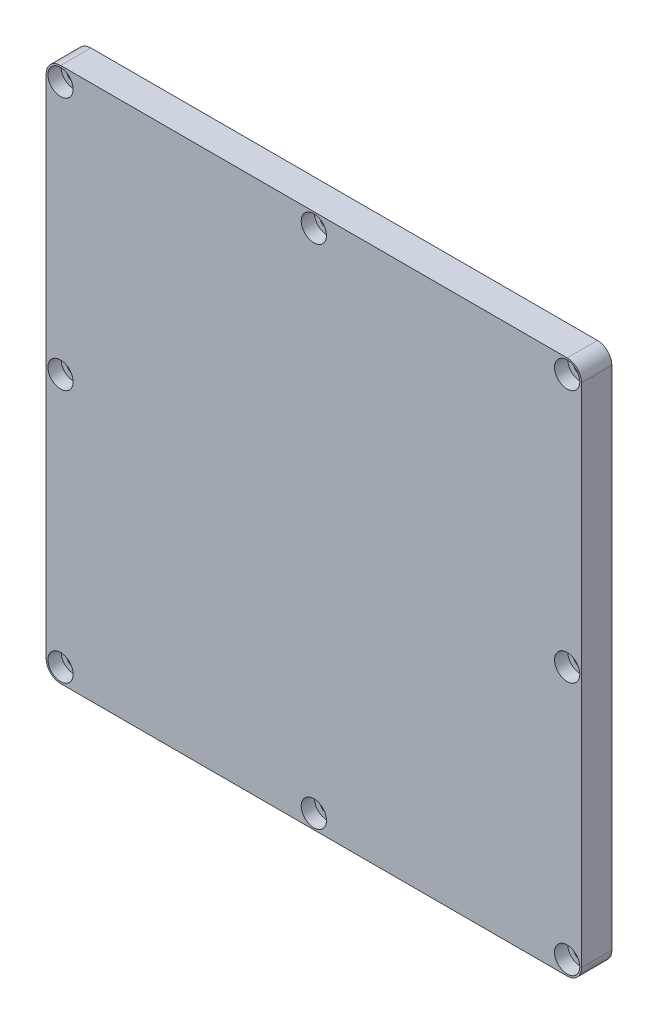
ISO-10303-21;
HEADER;
FILE_DESCRIPTION(('STEP AP214'),'2;1');
FILE_NAME('part.step','',(''),(''),'','','');
FILE_SCHEMA(('AUTOMOTIVE_DESIGN { 1 0 10303 214 1 1 1 1 }'));
ENDSEC;
DATA;
#1=APPLICATION_CONTEXT('core data for automotive mechanical design processes');
#2=APPLICATION_PROTOCOL_DEFINITION('international standard','automotive_design',2000,#1);
#3=PRODUCT_CONTEXT('',#1,'mechanical');
#4=PRODUCT('Part','Part','',(#3));
#5=PRODUCT_RELATED_PRODUCT_CATEGORY('part','',(#4));
#6=PRODUCT_DEFINITION_FORMATION('','',#4);
#7=PRODUCT_DEFINITION_CONTEXT('part definition',#1,'design');
#8=PRODUCT_DEFINITION('design','',#6,#7);
#9=PRODUCT_DEFINITION_SHAPE('','',#8);
#10=(LENGTH_UNIT() NAMED_UNIT(*) SI_UNIT(.MILLI.,.METRE.));
#11=(NAMED_UNIT(*) PLANE_ANGLE_UNIT() SI_UNIT($,.RADIAN.));
#12=(NAMED_UNIT(*) SI_UNIT($,.STERADIAN.) SOLID_ANGLE_UNIT());
#13=UNCERTAINTY_MEASURE_WITH_UNIT(LENGTH_MEASURE(1.E-05),#10,'distance_accuracy_value','');
#14=(GEOMETRIC_REPRESENTATION_CONTEXT(3) GLOBAL_UNCERTAINTY_ASSIGNED_CONTEXT((#13)) GLOBAL_UNIT_ASSIGNED_CONTEXT((#10,
#11,#12)) REPRESENTATION_CONTEXT('',''));
#15=CARTESIAN_POINT('',(0.,0.,0.));
#16=DIRECTION('',(0.,0.,1.));
#17=DIRECTION('',(1.,0.,0.));
#18=AXIS2_PLACEMENT_3D('',#15,#16,#17);
#19=CARTESIAN_POINT('',(-84.1375,-84.1375,9.525));
#20=DIRECTION('',(1.,0.,0.));
#21=DIRECTION('',(0.,0.,-1.));
#22=AXIS2_PLACEMENT_3D('',#19,#20,#21);
#23=PLANE('',#22);
#24=DIRECTION('',(0.,-1.,0.));
#25=VECTOR('',#24,1.);
#26=CARTESIAN_POINT('',(-84.1375,-84.1375,0.));
#27=LINE('',#26,#25);
#28=CARTESIAN_POINT('',(-84.1375,79.6163,0.));
#29=VERTEX_POINT('',#28);
#30=CARTESIAN_POINT('',(-84.1375,-79.6163,0.));
#31=VERTEX_POINT('',#30);
#32=EDGE_CURVE('E127',#29,#31,#27,.T.);
#33=ORIENTED_EDGE('',*,*,#32,.T.);
#34=DIRECTION('',(0.,0.,-1.));
#35=VECTOR('',#34,1.);
#36=CARTESIAN_POINT('',(-84.1375,-79.6163,9.525));
#37=LINE('',#36,#35);
#38=CARTESIAN_POINT('',(-84.1375,-79.6163,9.525));
#39=VERTEX_POINT('',#38);
#40=EDGE_CURVE('E105',#31,#39,#37,.F.);
#41=ORIENTED_EDGE('',*,*,#40,.T.);
#42=DIRECTION('',(0.,-1.,0.));
#43=VECTOR('',#42,1.);
#44=CARTESIAN_POINT('',(-84.1375,-84.1375,9.525));
#45=LINE('',#44,#43);
#46=CARTESIAN_POINT('',(-84.1375,79.6163,9.525));
#47=VERTEX_POINT('',#46);
#48=EDGE_CURVE('E137',#47,#39,#45,.T.);
#49=ORIENTED_EDGE('',*,*,#48,.F.);
#50=DIRECTION('',(0.,0.,-1.));
#51=VECTOR('',#50,1.);
#52=CARTESIAN_POINT('',(-84.1375,79.6163,9.525));
#53=LINE('',#52,#51);
#54=EDGE_CURVE('E110',#47,#29,#53,.T.);
#55=ORIENTED_EDGE('',*,*,#54,.T.);
#56=EDGE_LOOP('',(#33,#41,#49,#55));
#57=FACE_BOUND('',#56,.T.);
#58=ADVANCED_FACE('F35',(#57),#23,.F.);
#59=CARTESIAN_POINT('',(84.1375,-84.1375,9.525));
#60=DIRECTION('',(0.,1.,0.));
#61=DIRECTION('',(-1.,0.,0.));
#62=AXIS2_PLACEMENT_3D('',#59,#60,#61);
#63=PLANE('',#62);
#64=DIRECTION('',(1.,0.,0.));
#65=VECTOR('',#64,1.);
#66=CARTESIAN_POINT('',(84.1375,-84.1375,9.525));
#67=LINE('',#66,#65);
#68=CARTESIAN_POINT('',(-79.6163,-84.1375,9.525));
#69=VERTEX_POINT('',#68);
#70=CARTESIAN_POINT('',(79.6163,-84.1375,9.525));
#71=VERTEX_POINT('',#70);
#72=EDGE_CURVE('E120',#69,#71,#67,.T.);
#73=ORIENTED_EDGE('',*,*,#72,.F.);
#74=DIRECTION('',(0.,0.,-1.));
#75=VECTOR('',#74,1.);
#76=CARTESIAN_POINT('',(-79.6163,-84.1375,9.525));
#77=LINE('',#76,#75);
#78=CARTESIAN_POINT('',(-79.6163,-84.1375,0.));
#79=VERTEX_POINT('',#78);
#80=EDGE_CURVE('E104',#69,#79,#77,.T.);
#81=ORIENTED_EDGE('',*,*,#80,.T.);
#82=DIRECTION('',(1.,0.,0.));
#83=VECTOR('',#82,1.);
#84=CARTESIAN_POINT('',(84.1375,-84.1375,0.));
#85=LINE('',#84,#83);
#86=CARTESIAN_POINT('',(79.6163,-84.1375,0.));
#87=VERTEX_POINT('',#86);
#88=EDGE_CURVE('E117',#79,#87,#85,.T.);
#89=ORIENTED_EDGE('',*,*,#88,.T.);
#90=DIRECTION('',(0.,0.,-1.));
#91=VECTOR('',#90,1.);
#92=CARTESIAN_POINT('',(79.6163,-84.1375,9.525));
#93=LINE('',#92,#91);
#94=EDGE_CURVE('E122',#87,#71,#93,.F.);
#95=ORIENTED_EDGE('',*,*,#94,.T.);
#96=EDGE_LOOP('',(#73,#81,#89,#95));
#97=FACE_BOUND('',#96,.T.);
#98=ADVANCED_FACE('F116',(#97),#63,.F.);
#99=CARTESIAN_POINT('',(84.1375,-84.1375,9.525));
#100=DIRECTION('',(-1.,0.,0.));
#101=DIRECTION('',(0.,0.,1.));
#102=AXIS2_PLACEMENT_3D('',#99,#100,#101);
#103=PLANE('',#102);
#104=DIRECTION('',(0.,1.,0.));
#105=VECTOR('',#104,1.);
#106=CARTESIAN_POINT('',(84.1375,-84.1375,9.525));
#107=LINE('',#106,#105);
#108=CARTESIAN_POINT('',(84.1375,-79.6163,9.525));
#109=VERTEX_POINT('',#108);
#110=CARTESIAN_POINT('',(84.1375,79.6163,9.525));
#111=VERTEX_POINT('',#110);
#112=EDGE_CURVE('E171',#109,#111,#107,.T.);
#113=ORIENTED_EDGE('',*,*,#112,.F.);
#114=DIRECTION('',(0.,0.,-1.));
#115=VECTOR('',#114,1.);
#116=CARTESIAN_POINT('',(84.1375,-79.6163,9.525));
#117=LINE('',#116,#115);
#118=CARTESIAN_POINT('',(84.1375,-79.6163,0.));
#119=VERTEX_POINT('',#118);
#120=EDGE_CURVE('E156',#109,#119,#117,.T.);
#121=ORIENTED_EDGE('',*,*,#120,.T.);
#122=DIRECTION('',(0.,1.,0.));
#123=VECTOR('',#122,1.);
#124=CARTESIAN_POINT('',(84.1375,-84.1375,0.));
#125=LINE('',#124,#123);
#126=CARTESIAN_POINT('',(84.1375,79.6163,0.));
#127=VERTEX_POINT('',#126);
#128=EDGE_CURVE('E126',#119,#127,#125,.T.);
#129=ORIENTED_EDGE('',*,*,#128,.T.);
#130=DIRECTION('',(0.,0.,-1.));
#131=VECTOR('',#130,1.);
#132=CARTESIAN_POINT('',(84.1375,79.6163,9.525));
#133=LINE('',#132,#131);
#134=EDGE_CURVE('E154',#127,#111,#133,.F.);
#135=ORIENTED_EDGE('',*,*,#134,.T.);
#136=EDGE_LOOP('',(#113,#121,#129,#135));
#137=FACE_BOUND('',#136,.T.);
#138=ADVANCED_FACE('F187',(#137),#103,.F.);
#139=CARTESIAN_POINT('',(84.1375,84.1375,9.525));
#140=DIRECTION('',(0.,-1.,0.));
#141=DIRECTION('',(1.,0.,0.));
#142=AXIS2_PLACEMENT_3D('',#139,#140,#141);
#143=PLANE('',#142);
#144=DIRECTION('',(-1.,0.,0.));
#145=VECTOR('',#144,1.);
#146=CARTESIAN_POINT('',(84.1375,84.1375,0.));
#147=LINE('',#146,#145);
#148=CARTESIAN_POINT('',(79.6163,84.1375,0.));
#149=VERTEX_POINT('',#148);
#150=CARTESIAN_POINT('',(-79.6163,84.1375,0.));
#151=VERTEX_POINT('',#150);
#152=EDGE_CURVE('E130',#149,#151,#147,.T.);
#153=ORIENTED_EDGE('',*,*,#152,.T.);
#154=DIRECTION('',(0.,0.,-1.));
#155=VECTOR('',#154,1.);
#156=CARTESIAN_POINT('',(-79.6163,84.1375,9.525));
#157=LINE('',#156,#155);
#158=CARTESIAN_POINT('',(-79.6163,84.1375,9.525));
#159=VERTEX_POINT('',#158);
#160=EDGE_CURVE('E11',#151,#159,#157,.F.);
#161=ORIENTED_EDGE('',*,*,#160,.T.);
#162=DIRECTION('',(-1.,0.,0.));
#163=VECTOR('',#162,1.);
#164=CARTESIAN_POINT('',(84.1375,84.1375,9.525));
#165=LINE('',#164,#163);
#166=CARTESIAN_POINT('',(79.6163,84.1375,9.525));
#167=VERTEX_POINT('',#166);
#168=EDGE_CURVE('E138',#167,#159,#165,.T.);
#169=ORIENTED_EDGE('',*,*,#168,.F.);
#170=DIRECTION('',(0.,0.,-1.));
#171=VECTOR('',#170,1.);
#172=CARTESIAN_POINT('',(79.6163,84.1375,9.525));
#173=LINE('',#172,#171);
#174=EDGE_CURVE('E43',#167,#149,#173,.T.);
#175=ORIENTED_EDGE('',*,*,#174,.T.);
#176=EDGE_LOOP('',(#153,#161,#169,#175));
#177=FACE_BOUND('',#176,.T.);
#178=ADVANCED_FACE('F161',(#177),#143,.F.);
#179=CARTESIAN_POINT('',(0.,0.,9.525));
#180=DIRECTION('',(0.,0.,1.));
#181=DIRECTION('',(1.,0.,0.));
#182=AXIS2_PLACEMENT_3D('',#179,#180,#181);
#183=PLANE('',#182);
#184=CARTESIAN_POINT('',(-79.629,79.629,9.525));
#185=DIRECTION('',(0.,0.,1.));
#186=DIRECTION('',(1.,0.,0.));
#187=AXIS2_PLACEMENT_3D('',#184,#185,#186);
#188=CIRCLE('',#187,3.96875000000001);
#189=CARTESIAN_POINT('',(-75.66025,79.629,9.525));
#190=VERTEX_POINT('',#189);
#191=EDGE_CURVE('E591',#190,#190,#188,.T.);
#192=ORIENTED_EDGE('',*,*,#191,.F.);
#193=EDGE_LOOP('',(#192));
#194=FACE_BOUND('',#193,.T.);
#195=CARTESIAN_POINT('',(-2.26207941267376E-12,79.629,9.525));
#196=DIRECTION('',(0.,0.,1.));
#197=DIRECTION('',(1.,0.,0.));
#198=AXIS2_PLACEMENT_3D('',#195,#196,#197);
#199=CIRCLE('',#198,3.96875);
#200=CARTESIAN_POINT('',(3.96874999999774,79.629,9.525));
#201=VERTEX_POINT('',#200);
#202=EDGE_CURVE('E579',#201,#201,#199,.T.);
#203=ORIENTED_EDGE('',*,*,#202,.F.);
#204=EDGE_LOOP('',(#203));
#205=FACE_BOUND('',#204,.T.);
#206=CARTESIAN_POINT('',(79.6289999999955,79.629,9.525));
#207=DIRECTION('',(0.,0.,1.));
#208=DIRECTION('',(1.,0.,0.));
#209=AXIS2_PLACEMENT_3D('',#206,#207,#208);
#210=CIRCLE('',#209,3.96875000000001);
#211=CARTESIAN_POINT('',(83.5977499999955,79.629,9.525));
#212=VERTEX_POINT('',#211);
#213=EDGE_CURVE('E567',#212,#212,#210,.T.);
#214=ORIENTED_EDGE('',*,*,#213,.F.);
#215=EDGE_LOOP('',(#214));
#216=FACE_BOUND('',#215,.T.);
#217=CARTESIAN_POINT('',(79.6289999999974,0.,9.525));
#218=DIRECTION('',(0.,0.,1.));
#219=DIRECTION('',(1.,0.,0.));
#220=AXIS2_PLACEMENT_3D('',#217,#218,#219);
#221=CIRCLE('',#220,3.96875000000001);
#222=CARTESIAN_POINT('',(83.5977499999974,0.,9.525));
#223=VERTEX_POINT('',#222);
#224=EDGE_CURVE('E555',#223,#223,#221,.T.);
#225=ORIENTED_EDGE('',*,*,#224,.F.);
#226=EDGE_LOOP('',(#225));
#227=FACE_BOUND('',#226,.T.);
#228=CARTESIAN_POINT('',(1.66533453693773E-12,-79.629,9.525));
#229=DIRECTION('',(0.,0.,1.));
#230=DIRECTION('',(1.,0.,0.));
#231=AXIS2_PLACEMENT_3D('',#228,#229,#230);
#232=CIRCLE('',#231,3.96875);
#233=CARTESIAN_POINT('',(3.96875000000167,-79.629,9.525));
#234=VERTEX_POINT('',#233);
#235=EDGE_CURVE('E543',#234,#234,#232,.T.);
#236=ORIENTED_EDGE('',*,*,#235,.F.);
#237=EDGE_LOOP('',(#236));
#238=FACE_BOUND('',#237,.T.);
#239=CARTESIAN_POINT('',(79.6289999999994,-79.629,9.525));
#240=DIRECTION('',(0.,0.,1.));
#241=DIRECTION('',(1.,0.,0.));
#242=AXIS2_PLACEMENT_3D('',#239,#240,#241);
#243=CIRCLE('',#242,3.96875000000001);
#244=CARTESIAN_POINT('',(83.5977499999994,-79.629,9.525));
#245=VERTEX_POINT('',#244);
#246=EDGE_CURVE('E531',#245,#245,#243,.T.);
#247=ORIENTED_EDGE('',*,*,#246,.F.);
#248=EDGE_LOOP('',(#247));
#249=FACE_BOUND('',#248,.T.);
#250=CARTESIAN_POINT('',(-79.6289999999992,0.,9.525));
#251=DIRECTION('',(0.,0.,1.));
#252=DIRECTION('',(1.,0.,0.));
#253=AXIS2_PLACEMENT_3D('',#250,#251,#252);
#254=CIRCLE('',#253,3.96875000000001);
#255=CARTESIAN_POINT('',(-75.6602499999992,0.,9.525));
#256=VERTEX_POINT('',#255);
#257=EDGE_CURVE('E519',#256,#256,#254,.T.);
#258=ORIENTED_EDGE('',*,*,#257,.F.);
#259=EDGE_LOOP('',(#258));
#260=FACE_BOUND('',#259,.T.);
#261=CARTESIAN_POINT('',(-79.6289999999961,-79.629,9.525));
#262=DIRECTION('',(0.,0.,1.));
#263=DIRECTION('',(1.,0.,0.));
#264=AXIS2_PLACEMENT_3D('',#261,#262,#263);
#265=CIRCLE('',#264,3.96874999999999);
#266=CARTESIAN_POINT('',(-75.6602499999961,-79.629,9.525));
#267=VERTEX_POINT('',#266);
#268=EDGE_CURVE('E505',#267,#267,#265,.T.);
#269=ORIENTED_EDGE('',*,*,#268,.F.);
#270=EDGE_LOOP('',(#269));
#271=FACE_BOUND('',#270,.T.);
#272=ORIENTED_EDGE('',*,*,#48,.T.);
#273=CARTESIAN_POINT('',(-79.6163,-79.6163,9.525));
#274=DIRECTION('',(0.,0.,1.));
#275=DIRECTION('',(1.,0.,0.));
#276=AXIS2_PLACEMENT_3D('',#273,#274,#275);
#277=CIRCLE('',#276,4.5212);
#278=EDGE_CURVE('E152',#39,#69,#277,.T.);
#279=ORIENTED_EDGE('',*,*,#278,.T.);
#280=ORIENTED_EDGE('',*,*,#72,.T.);
#281=CARTESIAN_POINT('',(79.6163,-79.6163,9.525));
#282=DIRECTION('',(0.,0.,1.));
#283=DIRECTION('',(1.,0.,0.));
#284=AXIS2_PLACEMENT_3D('',#281,#282,#283);
#285=CIRCLE('',#284,4.5212);
#286=EDGE_CURVE('E150',#71,#109,#285,.T.);
#287=ORIENTED_EDGE('',*,*,#286,.T.);
#288=ORIENTED_EDGE('',*,*,#112,.T.);
#289=CARTESIAN_POINT('',(79.6163,79.6163,9.525));
#290=DIRECTION('',(0.,0.,1.));
#291=DIRECTION('',(1.,0.,0.));
#292=AXIS2_PLACEMENT_3D('',#289,#290,#291);
#293=CIRCLE('',#292,4.5212);
#294=EDGE_CURVE('E55',#111,#167,#293,.T.);
#295=ORIENTED_EDGE('',*,*,#294,.T.);
#296=ORIENTED_EDGE('',*,*,#168,.T.);
#297=CARTESIAN_POINT('',(-79.6163,79.6163,9.525));
#298=DIRECTION('',(0.,0.,1.));
#299=DIRECTION('',(1.,0.,0.));
#300=AXIS2_PLACEMENT_3D('',#297,#298,#299);
#301=CIRCLE('',#300,4.5212);
#302=EDGE_CURVE('E148',#159,#47,#301,.T.);
#303=ORIENTED_EDGE('',*,*,#302,.T.);
#304=EDGE_LOOP('',(#272,#279,#280,#287,#288,#295,#296,#303));
#305=FACE_BOUND('',#304,.T.);
#306=ADVANCED_FACE('F176',(#194,#205,#216,#227,#238,#249,#260,#271,#305),#183,.T.);
#307=CARTESIAN_POINT('',(0.,0.,0.));
#308=DIRECTION('',(0.,0.,1.));
#309=DIRECTION('',(1.,0.,0.));
#310=AXIS2_PLACEMENT_3D('',#307,#308,#309);
#311=PLANE('',#310);
#312=CARTESIAN_POINT('',(-79.629,79.629,0.));
#313=DIRECTION('',(0.,0.,1.));
#314=DIRECTION('',(1.,0.,0.));
#315=AXIS2_PLACEMENT_3D('',#312,#313,#314);
#316=CIRCLE('',#315,2.2479);
#317=CARTESIAN_POINT('',(-77.3811,79.629,0.));
#318=VERTEX_POINT('',#317);
#319=EDGE_CURVE('E582',#318,#318,#316,.T.);
#320=ORIENTED_EDGE('',*,*,#319,.T.);
#321=EDGE_LOOP('',(#320));
#322=FACE_BOUND('',#321,.T.);
#323=CARTESIAN_POINT('',(-2.26207941267376E-12,79.629,0.));
#324=DIRECTION('',(0.,0.,1.));
#325=DIRECTION('',(1.,0.,0.));
#326=AXIS2_PLACEMENT_3D('',#323,#324,#325);
#327=CIRCLE('',#326,2.2479);
#328=CARTESIAN_POINT('',(2.24789999999774,79.629,0.));
#329=VERTEX_POINT('',#328);
#330=EDGE_CURVE('E570',#329,#329,#327,.T.);
#331=ORIENTED_EDGE('',*,*,#330,.T.);
#332=EDGE_LOOP('',(#331));
#333=FACE_BOUND('',#332,.T.);
#334=CARTESIAN_POINT('',(79.6289999999955,79.629,0.));
#335=DIRECTION('',(0.,0.,1.));
#336=DIRECTION('',(1.,0.,0.));
#337=AXIS2_PLACEMENT_3D('',#334,#335,#336);
#338=CIRCLE('',#337,2.2479);
#339=CARTESIAN_POINT('',(81.8768999999955,79.629,0.));
#340=VERTEX_POINT('',#339);
#341=EDGE_CURVE('E558',#340,#340,#338,.T.);
#342=ORIENTED_EDGE('',*,*,#341,.T.);
#343=EDGE_LOOP('',(#342));
#344=FACE_BOUND('',#343,.T.);
#345=CARTESIAN_POINT('',(79.6289999999974,0.,0.));
#346=DIRECTION('',(0.,0.,1.));
#347=DIRECTION('',(1.,0.,0.));
#348=AXIS2_PLACEMENT_3D('',#345,#346,#347);
#349=CIRCLE('',#348,2.2479);
#350=CARTESIAN_POINT('',(81.8768999999974,0.,0.));
#351=VERTEX_POINT('',#350);
#352=EDGE_CURVE('E546',#351,#351,#349,.T.);
#353=ORIENTED_EDGE('',*,*,#352,.T.);
#354=EDGE_LOOP('',(#353));
#355=FACE_BOUND('',#354,.T.);
#356=CARTESIAN_POINT('',(1.66533453693773E-12,-79.629,0.));
#357=DIRECTION('',(0.,0.,1.));
#358=DIRECTION('',(1.,0.,0.));
#359=AXIS2_PLACEMENT_3D('',#356,#357,#358);
#360=CIRCLE('',#359,2.2479);
#361=CARTESIAN_POINT('',(2.24790000000166,-79.629,0.));
#362=VERTEX_POINT('',#361);
#363=EDGE_CURVE('E534',#362,#362,#360,.T.);
#364=ORIENTED_EDGE('',*,*,#363,.T.);
#365=EDGE_LOOP('',(#364));
#366=FACE_BOUND('',#365,.T.);
#367=CARTESIAN_POINT('',(79.6289999999994,-79.629,0.));
#368=DIRECTION('',(0.,0.,1.));
#369=DIRECTION('',(1.,0.,0.));
#370=AXIS2_PLACEMENT_3D('',#367,#368,#369);
#371=CIRCLE('',#370,2.2479);
#372=CARTESIAN_POINT('',(81.8768999999994,-79.629,0.));
#373=VERTEX_POINT('',#372);
#374=EDGE_CURVE('E522',#373,#373,#371,.T.);
#375=ORIENTED_EDGE('',*,*,#374,.T.);
#376=EDGE_LOOP('',(#375));
#377=FACE_BOUND('',#376,.T.);
#378=CARTESIAN_POINT('',(-79.6289999999992,0.,0.));
#379=DIRECTION('',(0.,0.,1.));
#380=DIRECTION('',(1.,0.,0.));
#381=AXIS2_PLACEMENT_3D('',#378,#379,#380);
#382=CIRCLE('',#381,2.2479);
#383=CARTESIAN_POINT('',(-77.3810999999992,0.,0.));
#384=VERTEX_POINT('',#383);
#385=EDGE_CURVE('E510',#384,#384,#382,.T.);
#386=ORIENTED_EDGE('',*,*,#385,.T.);
#387=EDGE_LOOP('',(#386));
#388=FACE_BOUND('',#387,.T.);
#389=CARTESIAN_POINT('',(-79.6289999999961,-79.629,0.));
#390=DIRECTION('',(0.,0.,1.));
#391=DIRECTION('',(1.,0.,0.));
#392=AXIS2_PLACEMENT_3D('',#389,#390,#391);
#393=CIRCLE('',#392,2.2479);
#394=CARTESIAN_POINT('',(-77.3810999999961,-79.629,0.));
#395=VERTEX_POINT('',#394);
#396=EDGE_CURVE('E132',#395,#395,#393,.T.);
#397=ORIENTED_EDGE('',*,*,#396,.T.);
#398=EDGE_LOOP('',(#397));
#399=FACE_BOUND('',#398,.T.);
#400=ORIENTED_EDGE('',*,*,#88,.F.);
#401=CARTESIAN_POINT('',(-79.6163,-79.6163,0.));
#402=DIRECTION('',(0.,0.,1.));
#403=DIRECTION('',(1.,0.,0.));
#404=AXIS2_PLACEMENT_3D('',#401,#402,#403);
#405=CIRCLE('',#404,4.5212);
#406=EDGE_CURVE('E100',#79,#31,#405,.F.);
#407=ORIENTED_EDGE('',*,*,#406,.T.);
#408=ORIENTED_EDGE('',*,*,#32,.F.);
#409=CARTESIAN_POINT('',(-79.6163,79.6163,0.));
#410=DIRECTION('',(0.,0.,1.));
#411=DIRECTION('',(1.,0.,0.));
#412=AXIS2_PLACEMENT_3D('',#409,#410,#411);
#413=CIRCLE('',#412,4.5212);
#414=EDGE_CURVE('E141',#29,#151,#413,.F.);
#415=ORIENTED_EDGE('',*,*,#414,.T.);
#416=ORIENTED_EDGE('',*,*,#152,.F.);
#417=CARTESIAN_POINT('',(79.6163,79.6163,0.));
#418=DIRECTION('',(0.,0.,1.));
#419=DIRECTION('',(1.,0.,0.));
#420=AXIS2_PLACEMENT_3D('',#417,#418,#419);
#421=CIRCLE('',#420,4.5212);
#422=EDGE_CURVE('E121',#149,#127,#421,.F.);
#423=ORIENTED_EDGE('',*,*,#422,.T.);
#424=ORIENTED_EDGE('',*,*,#128,.F.);
#425=CARTESIAN_POINT('',(79.6163,-79.6163,0.));
#426=DIRECTION('',(0.,0.,1.));
#427=DIRECTION('',(1.,0.,0.));
#428=AXIS2_PLACEMENT_3D('',#425,#426,#427);
#429=CIRCLE('',#428,4.5212);
#430=EDGE_CURVE('E111',#119,#87,#429,.F.);
#431=ORIENTED_EDGE('',*,*,#430,.T.);
#432=EDGE_LOOP('',(#400,#407,#408,#415,#416,#423,#424,#431));
#433=FACE_BOUND('',#432,.T.);
#434=ADVANCED_FACE('F124',(#322,#333,#344,#355,#366,#377,#388,#399,#433),#311,.F.);
#435=CARTESIAN_POINT('',(-79.6289999999961,-79.629,9.525));
#436=DIRECTION('',(0.,0.,1.));
#437=DIRECTION('',(1.,0.,0.));
#438=AXIS2_PLACEMENT_3D('',#435,#436,#437);
#439=CYLINDRICAL_SURFACE('',#438,2.2479);
#440=ORIENTED_EDGE('',*,*,#396,.F.);
#441=EDGE_LOOP('',(#440));
#442=FACE_BOUND('',#441,.T.);
#443=CARTESIAN_POINT('',(-79.6289999999961,-79.629,5.3594));
#444=DIRECTION('',(0.,0.,1.));
#445=DIRECTION('',(1.,0.,0.));
#446=AXIS2_PLACEMENT_3D('',#443,#444,#445);
#447=CIRCLE('',#446,2.2479);
#448=CARTESIAN_POINT('',(-77.3810999999961,-79.629,5.3594));
#449=VERTEX_POINT('',#448);
#450=EDGE_CURVE('E502',#449,#449,#447,.T.);
#451=ORIENTED_EDGE('',*,*,#450,.T.);
#452=EDGE_LOOP('',(#451));
#453=FACE_BOUND('',#452,.T.);
#454=ADVANCED_FACE('F184',(#442,#453),#439,.F.);
#455=CARTESIAN_POINT('',(-77.3810999999961,-79.629,5.3594));
#456=DIRECTION('',(0.,0.,-1.));
#457=DIRECTION('',(-1.,0.,0.));
#458=AXIS2_PLACEMENT_3D('',#455,#456,#457);
#459=PLANE('',#458);
#460=ORIENTED_EDGE('',*,*,#450,.F.);
#461=EDGE_LOOP('',(#460));
#462=FACE_BOUND('',#461,.T.);
#463=CARTESIAN_POINT('',(-79.6289999999961,-79.629,5.3594));
#464=DIRECTION('',(0.,0.,1.));
#465=DIRECTION('',(1.,0.,0.));
#466=AXIS2_PLACEMENT_3D('',#463,#464,#465);
#467=CIRCLE('',#466,3.96874999999999);
#468=CARTESIAN_POINT('',(-75.6602499999961,-79.629,5.3594));
#469=VERTEX_POINT('',#468);
#470=EDGE_CURVE('E503',#469,#469,#467,.T.);
#471=ORIENTED_EDGE('',*,*,#470,.T.);
#472=EDGE_LOOP('',(#471));
#473=FACE_BOUND('',#472,.T.);
#474=ADVANCED_FACE('F434',(#462,#473),#459,.F.);
#475=CARTESIAN_POINT('',(-79.6289999999961,-79.629,9.525));
#476=DIRECTION('',(0.,0.,1.));
#477=DIRECTION('',(1.,0.,0.));
#478=AXIS2_PLACEMENT_3D('',#475,#476,#477);
#479=CYLINDRICAL_SURFACE('',#478,3.96874999999999);
#480=ORIENTED_EDGE('',*,*,#470,.F.);
#481=EDGE_LOOP('',(#480));
#482=FACE_BOUND('',#481,.T.);
#483=ORIENTED_EDGE('',*,*,#268,.T.);
#484=EDGE_LOOP('',(#483));
#485=FACE_BOUND('',#484,.T.);
#486=ADVANCED_FACE('F426',(#482,#485),#479,.F.);
#487=CARTESIAN_POINT('',(-79.6289999999992,0.,9.525));
#488=DIRECTION('',(0.,0.,1.));
#489=DIRECTION('',(1.,0.,0.));
#490=AXIS2_PLACEMENT_3D('',#487,#488,#489);
#491=CYLINDRICAL_SURFACE('',#490,2.2479);
#492=ORIENTED_EDGE('',*,*,#385,.F.);
#493=EDGE_LOOP('',(#492));
#494=FACE_BOUND('',#493,.T.);
#495=CARTESIAN_POINT('',(-79.6289999999992,0.,5.3594));
#496=DIRECTION('',(0.,0.,1.));
#497=DIRECTION('',(1.,0.,0.));
#498=AXIS2_PLACEMENT_3D('',#495,#496,#497);
#499=CIRCLE('',#498,2.2479);
#500=CARTESIAN_POINT('',(-77.3810999999992,0.,5.3594));
#501=VERTEX_POINT('',#500);
#502=EDGE_CURVE('E513',#501,#501,#499,.T.);
#503=ORIENTED_EDGE('',*,*,#502,.T.);
#504=EDGE_LOOP('',(#503));
#505=FACE_BOUND('',#504,.T.);
#506=ADVANCED_FACE('F418',(#494,#505),#491,.F.);
#507=CARTESIAN_POINT('',(-77.3810999999992,0.,5.3594));
#508=DIRECTION('',(0.,0.,-1.));
#509=DIRECTION('',(-1.,0.,0.));
#510=AXIS2_PLACEMENT_3D('',#507,#508,#509);
#511=PLANE('',#510);
#512=ORIENTED_EDGE('',*,*,#502,.F.);
#513=EDGE_LOOP('',(#512));
#514=FACE_BOUND('',#513,.T.);
#515=CARTESIAN_POINT('',(-79.6289999999992,0.,5.3594));
#516=DIRECTION('',(0.,0.,1.));
#517=DIRECTION('',(1.,0.,0.));
#518=AXIS2_PLACEMENT_3D('',#515,#516,#517);
#519=CIRCLE('',#518,3.96875000000001);
#520=CARTESIAN_POINT('',(-75.6602499999992,0.,5.3594));
#521=VERTEX_POINT('',#520);
#522=EDGE_CURVE('E516',#521,#521,#519,.T.);
#523=ORIENTED_EDGE('',*,*,#522,.T.);
#524=EDGE_LOOP('',(#523));
#525=FACE_BOUND('',#524,.T.);
#526=ADVANCED_FACE('F410',(#514,#525),#511,.F.);
#527=CARTESIAN_POINT('',(-79.6289999999992,0.,9.525));
#528=DIRECTION('',(0.,0.,1.));
#529=DIRECTION('',(1.,0.,0.));
#530=AXIS2_PLACEMENT_3D('',#527,#528,#529);
#531=CYLINDRICAL_SURFACE('',#530,3.96875000000001);
#532=ORIENTED_EDGE('',*,*,#522,.F.);
#533=EDGE_LOOP('',(#532));
#534=FACE_BOUND('',#533,.T.);
#535=ORIENTED_EDGE('',*,*,#257,.T.);
#536=EDGE_LOOP('',(#535));
#537=FACE_BOUND('',#536,.T.);
#538=ADVANCED_FACE('F402',(#534,#537),#531,.F.);
#539=CARTESIAN_POINT('',(79.6289999999994,-79.629,9.525));
#540=DIRECTION('',(0.,0.,1.));
#541=DIRECTION('',(1.,0.,0.));
#542=AXIS2_PLACEMENT_3D('',#539,#540,#541);
#543=CYLINDRICAL_SURFACE('',#542,2.2479);
#544=ORIENTED_EDGE('',*,*,#374,.F.);
#545=EDGE_LOOP('',(#544));
#546=FACE_BOUND('',#545,.T.);
#547=CARTESIAN_POINT('',(79.6289999999994,-79.629,5.3594));
#548=DIRECTION('',(0.,0.,1.));
#549=DIRECTION('',(1.,0.,0.));
#550=AXIS2_PLACEMENT_3D('',#547,#548,#549);
#551=CIRCLE('',#550,2.2479);
#552=CARTESIAN_POINT('',(81.8768999999994,-79.629,5.3594));
#553=VERTEX_POINT('',#552);
#554=EDGE_CURVE('E525',#553,#553,#551,.T.);
#555=ORIENTED_EDGE('',*,*,#554,.T.);
#556=EDGE_LOOP('',(#555));
#557=FACE_BOUND('',#556,.T.);
#558=ADVANCED_FACE('F394',(#546,#557),#543,.F.);
#559=CARTESIAN_POINT('',(81.8768999999994,-79.629,5.3594));
#560=DIRECTION('',(0.,0.,-1.));
#561=DIRECTION('',(-1.,0.,0.));
#562=AXIS2_PLACEMENT_3D('',#559,#560,#561);
#563=PLANE('',#562);
#564=ORIENTED_EDGE('',*,*,#554,.F.);
#565=EDGE_LOOP('',(#564));
#566=FACE_BOUND('',#565,.T.);
#567=CARTESIAN_POINT('',(79.6289999999994,-79.629,5.3594));
#568=DIRECTION('',(0.,0.,1.));
#569=DIRECTION('',(1.,0.,0.));
#570=AXIS2_PLACEMENT_3D('',#567,#568,#569);
#571=CIRCLE('',#570,3.96875000000001);
#572=CARTESIAN_POINT('',(83.5977499999994,-79.629,5.3594));
#573=VERTEX_POINT('',#572);
#574=EDGE_CURVE('E528',#573,#573,#571,.T.);
#575=ORIENTED_EDGE('',*,*,#574,.T.);
#576=EDGE_LOOP('',(#575));
#577=FACE_BOUND('',#576,.T.);
#578=ADVANCED_FACE('F386',(#566,#577),#563,.F.);
#579=CARTESIAN_POINT('',(79.6289999999994,-79.629,9.525));
#580=DIRECTION('',(0.,0.,1.));
#581=DIRECTION('',(1.,0.,0.));
#582=AXIS2_PLACEMENT_3D('',#579,#580,#581);
#583=CYLINDRICAL_SURFACE('',#582,3.96875000000001);
#584=ORIENTED_EDGE('',*,*,#574,.F.);
#585=EDGE_LOOP('',(#584));
#586=FACE_BOUND('',#585,.T.);
#587=ORIENTED_EDGE('',*,*,#246,.T.);
#588=EDGE_LOOP('',(#587));
#589=FACE_BOUND('',#588,.T.);
#590=ADVANCED_FACE('F378',(#586,#589),#583,.F.);
#591=CARTESIAN_POINT('',(1.66533453693773E-12,-79.629,9.525));
#592=DIRECTION('',(0.,0.,1.));
#593=DIRECTION('',(1.,0.,0.));
#594=AXIS2_PLACEMENT_3D('',#591,#592,#593);
#595=CYLINDRICAL_SURFACE('',#594,2.2479);
#596=ORIENTED_EDGE('',*,*,#363,.F.);
#597=EDGE_LOOP('',(#596));
#598=FACE_BOUND('',#597,.T.);
#599=CARTESIAN_POINT('',(1.66533453693773E-12,-79.629,5.3594));
#600=DIRECTION('',(0.,0.,1.));
#601=DIRECTION('',(1.,0.,0.));
#602=AXIS2_PLACEMENT_3D('',#599,#600,#601);
#603=CIRCLE('',#602,2.2479);
#604=CARTESIAN_POINT('',(2.24790000000166,-79.629,5.3594));
#605=VERTEX_POINT('',#604);
#606=EDGE_CURVE('E537',#605,#605,#603,.T.);
#607=ORIENTED_EDGE('',*,*,#606,.T.);
#608=EDGE_LOOP('',(#607));
#609=FACE_BOUND('',#608,.T.);
#610=ADVANCED_FACE('F370',(#598,#609),#595,.F.);
#611=CARTESIAN_POINT('',(2.24790000000166,-79.629,5.3594));
#612=DIRECTION('',(0.,0.,-1.));
#613=DIRECTION('',(-1.,0.,0.));
#614=AXIS2_PLACEMENT_3D('',#611,#612,#613);
#615=PLANE('',#614);
#616=ORIENTED_EDGE('',*,*,#606,.F.);
#617=EDGE_LOOP('',(#616));
#618=FACE_BOUND('',#617,.T.);
#619=CARTESIAN_POINT('',(1.66533453693773E-12,-79.629,5.3594));
#620=DIRECTION('',(0.,0.,1.));
#621=DIRECTION('',(1.,0.,0.));
#622=AXIS2_PLACEMENT_3D('',#619,#620,#621);
#623=CIRCLE('',#622,3.96875);
#624=CARTESIAN_POINT('',(3.96875000000167,-79.629,5.3594));
#625=VERTEX_POINT('',#624);
#626=EDGE_CURVE('E540',#625,#625,#623,.T.);
#627=ORIENTED_EDGE('',*,*,#626,.T.);
#628=EDGE_LOOP('',(#627));
#629=FACE_BOUND('',#628,.T.);
#630=ADVANCED_FACE('F362',(#618,#629),#615,.F.);
#631=CARTESIAN_POINT('',(1.66533453693773E-12,-79.629,9.525));
#632=DIRECTION('',(0.,0.,1.));
#633=DIRECTION('',(1.,0.,0.));
#634=AXIS2_PLACEMENT_3D('',#631,#632,#633);
#635=CYLINDRICAL_SURFACE('',#634,3.96875);
#636=ORIENTED_EDGE('',*,*,#626,.F.);
#637=EDGE_LOOP('',(#636));
#638=FACE_BOUND('',#637,.T.);
#639=ORIENTED_EDGE('',*,*,#235,.T.);
#640=EDGE_LOOP('',(#639));
#641=FACE_BOUND('',#640,.T.);
#642=ADVANCED_FACE('F354',(#638,#641),#635,.F.);
#643=CARTESIAN_POINT('',(79.6289999999974,0.,9.525));
#644=DIRECTION('',(0.,0.,1.));
#645=DIRECTION('',(1.,0.,0.));
#646=AXIS2_PLACEMENT_3D('',#643,#644,#645);
#647=CYLINDRICAL_SURFACE('',#646,2.2479);
#648=ORIENTED_EDGE('',*,*,#352,.F.);
#649=EDGE_LOOP('',(#648));
#650=FACE_BOUND('',#649,.T.);
#651=CARTESIAN_POINT('',(79.6289999999974,0.,5.3594));
#652=DIRECTION('',(0.,0.,1.));
#653=DIRECTION('',(1.,0.,0.));
#654=AXIS2_PLACEMENT_3D('',#651,#652,#653);
#655=CIRCLE('',#654,2.2479);
#656=CARTESIAN_POINT('',(81.8768999999974,0.,5.3594));
#657=VERTEX_POINT('',#656);
#658=EDGE_CURVE('E549',#657,#657,#655,.T.);
#659=ORIENTED_EDGE('',*,*,#658,.T.);
#660=EDGE_LOOP('',(#659));
#661=FACE_BOUND('',#660,.T.);
#662=ADVANCED_FACE('F346',(#650,#661),#647,.F.);
#663=CARTESIAN_POINT('',(81.8768999999974,0.,5.3594));
#664=DIRECTION('',(0.,0.,-1.));
#665=DIRECTION('',(-1.,0.,0.));
#666=AXIS2_PLACEMENT_3D('',#663,#664,#665);
#667=PLANE('',#666);
#668=ORIENTED_EDGE('',*,*,#658,.F.);
#669=EDGE_LOOP('',(#668));
#670=FACE_BOUND('',#669,.T.);
#671=CARTESIAN_POINT('',(79.6289999999974,0.,5.3594));
#672=DIRECTION('',(0.,0.,1.));
#673=DIRECTION('',(1.,0.,0.));
#674=AXIS2_PLACEMENT_3D('',#671,#672,#673);
#675=CIRCLE('',#674,3.96875000000001);
#676=CARTESIAN_POINT('',(83.5977499999974,0.,5.3594));
#677=VERTEX_POINT('',#676);
#678=EDGE_CURVE('E552',#677,#677,#675,.T.);
#679=ORIENTED_EDGE('',*,*,#678,.T.);
#680=EDGE_LOOP('',(#679));
#681=FACE_BOUND('',#680,.T.);
#682=ADVANCED_FACE('F338',(#670,#681),#667,.F.);
#683=CARTESIAN_POINT('',(79.6289999999974,0.,9.525));
#684=DIRECTION('',(0.,0.,1.));
#685=DIRECTION('',(1.,0.,0.));
#686=AXIS2_PLACEMENT_3D('',#683,#684,#685);
#687=CYLINDRICAL_SURFACE('',#686,3.96875000000001);
#688=ORIENTED_EDGE('',*,*,#678,.F.);
#689=EDGE_LOOP('',(#688));
#690=FACE_BOUND('',#689,.T.);
#691=ORIENTED_EDGE('',*,*,#224,.T.);
#692=EDGE_LOOP('',(#691));
#693=FACE_BOUND('',#692,.T.);
#694=ADVANCED_FACE('F330',(#690,#693),#687,.F.);
#695=CARTESIAN_POINT('',(79.6289999999955,79.629,9.525));
#696=DIRECTION('',(0.,0.,1.));
#697=DIRECTION('',(1.,0.,0.));
#698=AXIS2_PLACEMENT_3D('',#695,#696,#697);
#699=CYLINDRICAL_SURFACE('',#698,2.2479);
#700=ORIENTED_EDGE('',*,*,#341,.F.);
#701=EDGE_LOOP('',(#700));
#702=FACE_BOUND('',#701,.T.);
#703=CARTESIAN_POINT('',(79.6289999999955,79.629,5.3594));
#704=DIRECTION('',(0.,0.,1.));
#705=DIRECTION('',(1.,0.,0.));
#706=AXIS2_PLACEMENT_3D('',#703,#704,#705);
#707=CIRCLE('',#706,2.2479);
#708=CARTESIAN_POINT('',(81.8768999999955,79.629,5.3594));
#709=VERTEX_POINT('',#708);
#710=EDGE_CURVE('E561',#709,#709,#707,.T.);
#711=ORIENTED_EDGE('',*,*,#710,.T.);
#712=EDGE_LOOP('',(#711));
#713=FACE_BOUND('',#712,.T.);
#714=ADVANCED_FACE('F322',(#702,#713),#699,.F.);
#715=CARTESIAN_POINT('',(81.8768999999955,79.629,5.3594));
#716=DIRECTION('',(0.,0.,-1.));
#717=DIRECTION('',(-1.,0.,0.));
#718=AXIS2_PLACEMENT_3D('',#715,#716,#717);
#719=PLANE('',#718);
#720=ORIENTED_EDGE('',*,*,#710,.F.);
#721=EDGE_LOOP('',(#720));
#722=FACE_BOUND('',#721,.T.);
#723=CARTESIAN_POINT('',(79.6289999999955,79.629,5.3594));
#724=DIRECTION('',(0.,0.,1.));
#725=DIRECTION('',(1.,0.,0.));
#726=AXIS2_PLACEMENT_3D('',#723,#724,#725);
#727=CIRCLE('',#726,3.96875000000001);
#728=CARTESIAN_POINT('',(83.5977499999955,79.629,5.3594));
#729=VERTEX_POINT('',#728);
#730=EDGE_CURVE('E564',#729,#729,#727,.T.);
#731=ORIENTED_EDGE('',*,*,#730,.T.);
#732=EDGE_LOOP('',(#731));
#733=FACE_BOUND('',#732,.T.);
#734=ADVANCED_FACE('F314',(#722,#733),#719,.F.);
#735=CARTESIAN_POINT('',(79.6289999999955,79.629,9.525));
#736=DIRECTION('',(0.,0.,1.));
#737=DIRECTION('',(1.,0.,0.));
#738=AXIS2_PLACEMENT_3D('',#735,#736,#737);
#739=CYLINDRICAL_SURFACE('',#738,3.96875000000001);
#740=ORIENTED_EDGE('',*,*,#730,.F.);
#741=EDGE_LOOP('',(#740));
#742=FACE_BOUND('',#741,.T.);
#743=ORIENTED_EDGE('',*,*,#213,.T.);
#744=EDGE_LOOP('',(#743));
#745=FACE_BOUND('',#744,.T.);
#746=ADVANCED_FACE('F306',(#742,#745),#739,.F.);
#747=CARTESIAN_POINT('',(-2.26207941267376E-12,79.629,9.525));
#748=DIRECTION('',(0.,0.,1.));
#749=DIRECTION('',(1.,0.,0.));
#750=AXIS2_PLACEMENT_3D('',#747,#748,#749);
#751=CYLINDRICAL_SURFACE('',#750,2.2479);
#752=ORIENTED_EDGE('',*,*,#330,.F.);
#753=EDGE_LOOP('',(#752));
#754=FACE_BOUND('',#753,.T.);
#755=CARTESIAN_POINT('',(-2.26207941267376E-12,79.629,5.3594));
#756=DIRECTION('',(0.,0.,1.));
#757=DIRECTION('',(1.,0.,0.));
#758=AXIS2_PLACEMENT_3D('',#755,#756,#757);
#759=CIRCLE('',#758,2.2479);
#760=CARTESIAN_POINT('',(2.24789999999774,79.629,5.3594));
#761=VERTEX_POINT('',#760);
#762=EDGE_CURVE('E573',#761,#761,#759,.T.);
#763=ORIENTED_EDGE('',*,*,#762,.T.);
#764=EDGE_LOOP('',(#763));
#765=FACE_BOUND('',#764,.T.);
#766=ADVANCED_FACE('F298',(#754,#765),#751,.F.);
#767=CARTESIAN_POINT('',(2.24789999999774,79.629,5.3594));
#768=DIRECTION('',(0.,0.,-1.));
#769=DIRECTION('',(-1.,0.,0.));
#770=AXIS2_PLACEMENT_3D('',#767,#768,#769);
#771=PLANE('',#770);
#772=ORIENTED_EDGE('',*,*,#762,.F.);
#773=EDGE_LOOP('',(#772));
#774=FACE_BOUND('',#773,.T.);
#775=CARTESIAN_POINT('',(-2.26207941267376E-12,79.629,5.3594));
#776=DIRECTION('',(0.,0.,1.));
#777=DIRECTION('',(1.,0.,0.));
#778=AXIS2_PLACEMENT_3D('',#775,#776,#777);
#779=CIRCLE('',#778,3.96875);
#780=CARTESIAN_POINT('',(3.96874999999774,79.629,5.3594));
#781=VERTEX_POINT('',#780);
#782=EDGE_CURVE('E576',#781,#781,#779,.T.);
#783=ORIENTED_EDGE('',*,*,#782,.T.);
#784=EDGE_LOOP('',(#783));
#785=FACE_BOUND('',#784,.T.);
#786=ADVANCED_FACE('F290',(#774,#785),#771,.F.);
#787=CARTESIAN_POINT('',(-2.26207941267376E-12,79.629,9.525));
#788=DIRECTION('',(0.,0.,1.));
#789=DIRECTION('',(1.,0.,0.));
#790=AXIS2_PLACEMENT_3D('',#787,#788,#789);
#791=CYLINDRICAL_SURFACE('',#790,3.96875);
#792=ORIENTED_EDGE('',*,*,#782,.F.);
#793=EDGE_LOOP('',(#792));
#794=FACE_BOUND('',#793,.T.);
#795=ORIENTED_EDGE('',*,*,#202,.T.);
#796=EDGE_LOOP('',(#795));
#797=FACE_BOUND('',#796,.T.);
#798=ADVANCED_FACE('F282',(#794,#797),#791,.F.);
#799=CARTESIAN_POINT('',(-79.629,79.629,9.525));
#800=DIRECTION('',(0.,0.,1.));
#801=DIRECTION('',(1.,0.,0.));
#802=AXIS2_PLACEMENT_3D('',#799,#800,#801);
#803=CYLINDRICAL_SURFACE('',#802,2.2479);
#804=ORIENTED_EDGE('',*,*,#319,.F.);
#805=EDGE_LOOP('',(#804));
#806=FACE_BOUND('',#805,.T.);
#807=CARTESIAN_POINT('',(-79.629,79.629,5.3594));
#808=DIRECTION('',(0.,0.,1.));
#809=DIRECTION('',(1.,0.,0.));
#810=AXIS2_PLACEMENT_3D('',#807,#808,#809);
#811=CIRCLE('',#810,2.2479);
#812=CARTESIAN_POINT('',(-77.3811,79.629,5.3594));
#813=VERTEX_POINT('',#812);
#814=EDGE_CURVE('E585',#813,#813,#811,.T.);
#815=ORIENTED_EDGE('',*,*,#814,.T.);
#816=EDGE_LOOP('',(#815));
#817=FACE_BOUND('',#816,.T.);
#818=ADVANCED_FACE('F274',(#806,#817),#803,.F.);
#819=CARTESIAN_POINT('',(-77.3811,79.629,5.3594));
#820=DIRECTION('',(0.,0.,-1.));
#821=DIRECTION('',(-1.,0.,0.));
#822=AXIS2_PLACEMENT_3D('',#819,#820,#821);
#823=PLANE('',#822);
#824=ORIENTED_EDGE('',*,*,#814,.F.);
#825=EDGE_LOOP('',(#824));
#826=FACE_BOUND('',#825,.T.);
#827=CARTESIAN_POINT('',(-79.629,79.629,5.3594));
#828=DIRECTION('',(0.,0.,1.));
#829=DIRECTION('',(1.,0.,0.));
#830=AXIS2_PLACEMENT_3D('',#827,#828,#829);
#831=CIRCLE('',#830,3.96875000000001);
#832=CARTESIAN_POINT('',(-75.66025,79.629,5.3594));
#833=VERTEX_POINT('',#832);
#834=EDGE_CURVE('E588',#833,#833,#831,.T.);
#835=ORIENTED_EDGE('',*,*,#834,.T.);
#836=EDGE_LOOP('',(#835));
#837=FACE_BOUND('',#836,.T.);
#838=ADVANCED_FACE('F267',(#826,#837),#823,.F.);
#839=CARTESIAN_POINT('',(-79.629,79.629,9.525));
#840=DIRECTION('',(0.,0.,1.));
#841=DIRECTION('',(1.,0.,0.));
#842=AXIS2_PLACEMENT_3D('',#839,#840,#841);
#843=CYLINDRICAL_SURFACE('',#842,3.96875000000001);
#844=ORIENTED_EDGE('',*,*,#834,.F.);
#845=EDGE_LOOP('',(#844));
#846=FACE_BOUND('',#845,.T.);
#847=ORIENTED_EDGE('',*,*,#191,.T.);
#848=EDGE_LOOP('',(#847));
#849=FACE_BOUND('',#848,.T.);
#850=ADVANCED_FACE('F203',(#846,#849),#843,.F.);
#851=CARTESIAN_POINT('',(-79.6163,-79.6163,9.525));
#852=DIRECTION('',(0.,0.,-1.));
#853=DIRECTION('',(-1.,0.,0.));
#854=AXIS2_PLACEMENT_3D('',#851,#852,#853);
#855=CYLINDRICAL_SURFACE('',#854,4.5212);
#856=ORIENTED_EDGE('',*,*,#278,.F.);
#857=ORIENTED_EDGE('',*,*,#40,.F.);
#858=ORIENTED_EDGE('',*,*,#406,.F.);
#859=ORIENTED_EDGE('',*,*,#80,.F.);
#860=EDGE_LOOP('',(#856,#857,#858,#859));
#861=FACE_BOUND('',#860,.T.);
#862=ADVANCED_FACE('F103',(#861),#855,.T.);
#863=CARTESIAN_POINT('',(79.6163,-79.6163,9.525));
#864=DIRECTION('',(0.,0.,-1.));
#865=DIRECTION('',(-1.,0.,0.));
#866=AXIS2_PLACEMENT_3D('',#863,#864,#865);
#867=CYLINDRICAL_SURFACE('',#866,4.5212);
#868=ORIENTED_EDGE('',*,*,#286,.F.);
#869=ORIENTED_EDGE('',*,*,#94,.F.);
#870=ORIENTED_EDGE('',*,*,#430,.F.);
#871=ORIENTED_EDGE('',*,*,#120,.F.);
#872=EDGE_LOOP('',(#868,#869,#870,#871));
#873=FACE_BOUND('',#872,.T.);
#874=ADVANCED_FACE('F202',(#873),#867,.T.);
#875=CARTESIAN_POINT('',(-79.6163,79.6163,9.525));
#876=DIRECTION('',(0.,0.,-1.));
#877=DIRECTION('',(-1.,0.,0.));
#878=AXIS2_PLACEMENT_3D('',#875,#876,#877);
#879=CYLINDRICAL_SURFACE('',#878,4.5212);
#880=ORIENTED_EDGE('',*,*,#302,.F.);
#881=ORIENTED_EDGE('',*,*,#160,.F.);
#882=ORIENTED_EDGE('',*,*,#414,.F.);
#883=ORIENTED_EDGE('',*,*,#54,.F.);
#884=EDGE_LOOP('',(#880,#881,#882,#883));
#885=FACE_BOUND('',#884,.T.);
#886=ADVANCED_FACE('F166',(#885),#879,.T.);
#887=CARTESIAN_POINT('',(79.6163,79.6163,9.525));
#888=DIRECTION('',(0.,0.,-1.));
#889=DIRECTION('',(-1.,0.,0.));
#890=AXIS2_PLACEMENT_3D('',#887,#888,#889);
#891=CYLINDRICAL_SURFACE('',#890,4.5212);
#892=ORIENTED_EDGE('',*,*,#294,.F.);
#893=ORIENTED_EDGE('',*,*,#134,.F.);
#894=ORIENTED_EDGE('',*,*,#422,.F.);
#895=ORIENTED_EDGE('',*,*,#174,.F.);
#896=EDGE_LOOP('',(#892,#893,#894,#895));
#897=FACE_BOUND('',#896,.T.);
#898=ADVANCED_FACE('F37',(#897),#891,.T.);
#899=CLOSED_SHELL('',(#58,#98,#138,#178,#306,#434,#454,#474,#486,#506,#526,#538,#558,#578,#590,
#610,#630,#642,#662,#682,#694,#714,#734,#746,#766,#786,#798,#818,#838,#850,#862,#874,#886,#898));
#900=MANIFOLD_SOLID_BREP('B2',#899);
#901=ADVANCED_BREP_SHAPE_REPRESENTATION('',(#18,#900),#14);
#902=SHAPE_DEFINITION_REPRESENTATION(#9,#901);
ENDSEC;
END-ISO-10303-21;
